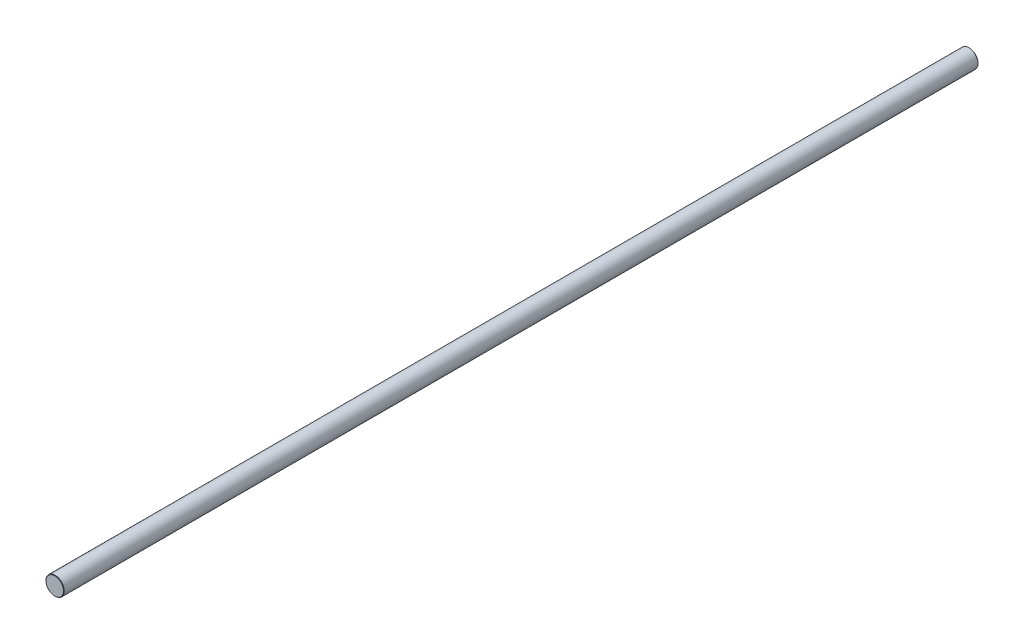
ISO-10303-21;
HEADER;
FILE_DESCRIPTION(('STEP AP214'),'2;1');
FILE_NAME('part.step','',(''),(''),'','','');
FILE_SCHEMA(('AUTOMOTIVE_DESIGN { 1 0 10303 214 1 1 1 1 }'));
ENDSEC;
DATA;
#1=APPLICATION_CONTEXT('core data for automotive mechanical design processes');
#2=APPLICATION_PROTOCOL_DEFINITION('international standard','automotive_design',2000,#1);
#3=PRODUCT_CONTEXT('',#1,'mechanical');
#4=PRODUCT('Part','Part','',(#3));
#5=PRODUCT_RELATED_PRODUCT_CATEGORY('part','',(#4));
#6=PRODUCT_DEFINITION_FORMATION('','',#4);
#7=PRODUCT_DEFINITION_CONTEXT('part definition',#1,'design');
#8=PRODUCT_DEFINITION('design','',#6,#7);
#9=PRODUCT_DEFINITION_SHAPE('','',#8);
#10=(LENGTH_UNIT() NAMED_UNIT(*) SI_UNIT(.MILLI.,.METRE.));
#11=(NAMED_UNIT(*) PLANE_ANGLE_UNIT() SI_UNIT($,.RADIAN.));
#12=(NAMED_UNIT(*) SI_UNIT($,.STERADIAN.) SOLID_ANGLE_UNIT());
#13=UNCERTAINTY_MEASURE_WITH_UNIT(LENGTH_MEASURE(1.E-05),#10,'distance_accuracy_value','');
#14=(GEOMETRIC_REPRESENTATION_CONTEXT(3) GLOBAL_UNCERTAINTY_ASSIGNED_CONTEXT((#13)) GLOBAL_UNIT_ASSIGNED_CONTEXT((#10,
#11,#12)) REPRESENTATION_CONTEXT('',''));
#15=CARTESIAN_POINT('',(0.,0.,0.));
#16=DIRECTION('',(0.,0.,1.));
#17=DIRECTION('',(1.,0.,0.));
#18=AXIS2_PLACEMENT_3D('',#15,#16,#17);
#19=CARTESIAN_POINT('',(0.,0.,500.));
#20=DIRECTION('',(0.,0.,-1.));
#21=DIRECTION('',(-1.,0.,0.));
#22=AXIS2_PLACEMENT_3D('',#19,#20,#21);
#23=CYLINDRICAL_SURFACE('',#22,10.);
#24=CARTESIAN_POINT('',(0.,0.,-499.6));
#25=DIRECTION('',(0.,0.,1.));
#26=DIRECTION('',(1.,0.,0.));
#27=AXIS2_PLACEMENT_3D('',#24,#25,#26);
#28=CIRCLE('',#27,10.);
#29=CARTESIAN_POINT('',(10.,0.,-499.6));
#30=VERTEX_POINT('',#29);
#31=EDGE_CURVE('E48',#30,#30,#28,.T.);
#32=ORIENTED_EDGE('',*,*,#31,.T.);
#33=EDGE_LOOP('',(#32));
#34=FACE_BOUND('',#33,.T.);
#35=CARTESIAN_POINT('',(0.,0.,499.6));
#36=DIRECTION('',(0.,0.,1.));
#37=DIRECTION('',(1.,0.,0.));
#38=AXIS2_PLACEMENT_3D('',#35,#36,#37);
#39=CIRCLE('',#38,10.);
#40=CARTESIAN_POINT('',(10.,0.,499.6));
#41=VERTEX_POINT('',#40);
#42=EDGE_CURVE('E52',#41,#41,#39,.F.);
#43=ORIENTED_EDGE('',*,*,#42,.T.);
#44=EDGE_LOOP('',(#43));
#45=FACE_BOUND('',#44,.T.);
#46=ADVANCED_FACE('F37',(#34,#45),#23,.T.);
#47=CARTESIAN_POINT('',(0.,0.,500.));
#48=DIRECTION('',(0.,0.,1.));
#49=DIRECTION('',(1.,0.,0.));
#50=AXIS2_PLACEMENT_3D('',#47,#48,#49);
#51=PLANE('',#50);
#52=CARTESIAN_POINT('',(0.,0.,500.));
#53=DIRECTION('',(0.,0.,1.));
#54=DIRECTION('',(1.,0.,0.));
#55=AXIS2_PLACEMENT_3D('',#52,#53,#54);
#56=CIRCLE('',#55,9.60000000000027);
#57=CARTESIAN_POINT('',(9.60000000000027,0.,500.));
#58=VERTEX_POINT('',#57);
#59=EDGE_CURVE('E10',#58,#58,#56,.T.);
#60=ORIENTED_EDGE('',*,*,#59,.T.);
#61=EDGE_LOOP('',(#60));
#62=FACE_BOUND('',#61,.T.);
#63=ADVANCED_FACE('F68',(#62),#51,.T.);
#64=CARTESIAN_POINT('',(0.,0.,-500.));
#65=DIRECTION('',(0.,0.,1.));
#66=DIRECTION('',(1.,0.,0.));
#67=AXIS2_PLACEMENT_3D('',#64,#65,#66);
#68=PLANE('',#67);
#69=CARTESIAN_POINT('',(0.,0.,-500.));
#70=DIRECTION('',(0.,0.,1.));
#71=DIRECTION('',(1.,0.,0.));
#72=AXIS2_PLACEMENT_3D('',#69,#70,#71);
#73=CIRCLE('',#72,9.60000000000005);
#74=CARTESIAN_POINT('',(9.60000000000005,0.,-500.));
#75=VERTEX_POINT('',#74);
#76=EDGE_CURVE('E44',#75,#75,#73,.F.);
#77=ORIENTED_EDGE('',*,*,#76,.T.);
#78=EDGE_LOOP('',(#77));
#79=FACE_BOUND('',#78,.T.);
#80=ADVANCED_FACE('F65',(#79),#68,.F.);
#81=CARTESIAN_POINT('',(0.,0.,-499.6));
#82=DIRECTION('',(0.,0.,1.));
#83=DIRECTION('',(1.,0.,0.));
#84=AXIS2_PLACEMENT_3D('',#81,#82,#83);
#85=CONICAL_SURFACE('',#84,10.,0.785398163397438);
#86=ORIENTED_EDGE('',*,*,#76,.F.);
#87=EDGE_LOOP('',(#86));
#88=FACE_BOUND('',#87,.T.);
#89=ORIENTED_EDGE('',*,*,#31,.F.);
#90=EDGE_LOOP('',(#89));
#91=FACE_BOUND('',#90,.T.);
#92=ADVANCED_FACE('F61',(#88,#91),#85,.T.);
#93=CARTESIAN_POINT('',(0.,0.,500.));
#94=DIRECTION('',(0.,0.,-1.));
#95=DIRECTION('',(-1.,0.,0.));
#96=AXIS2_PLACEMENT_3D('',#93,#94,#95);
#97=CONICAL_SURFACE('',#96,9.60000000000027,0.785398163397438);
#98=ORIENTED_EDGE('',*,*,#42,.F.);
#99=EDGE_LOOP('',(#98));
#100=FACE_BOUND('',#99,.T.);
#101=ORIENTED_EDGE('',*,*,#59,.F.);
#102=EDGE_LOOP('',(#101));
#103=FACE_BOUND('',#102,.T.);
#104=ADVANCED_FACE('F39',(#100,#103),#97,.T.);
#105=CLOSED_SHELL('',(#46,#63,#80,#92,#104));
#106=MANIFOLD_SOLID_BREP('B2',#105);
#107=ADVANCED_BREP_SHAPE_REPRESENTATION('',(#18,#106),#14);
#108=SHAPE_DEFINITION_REPRESENTATION(#9,#107);
ENDSEC;
END-ISO-10303-21;
